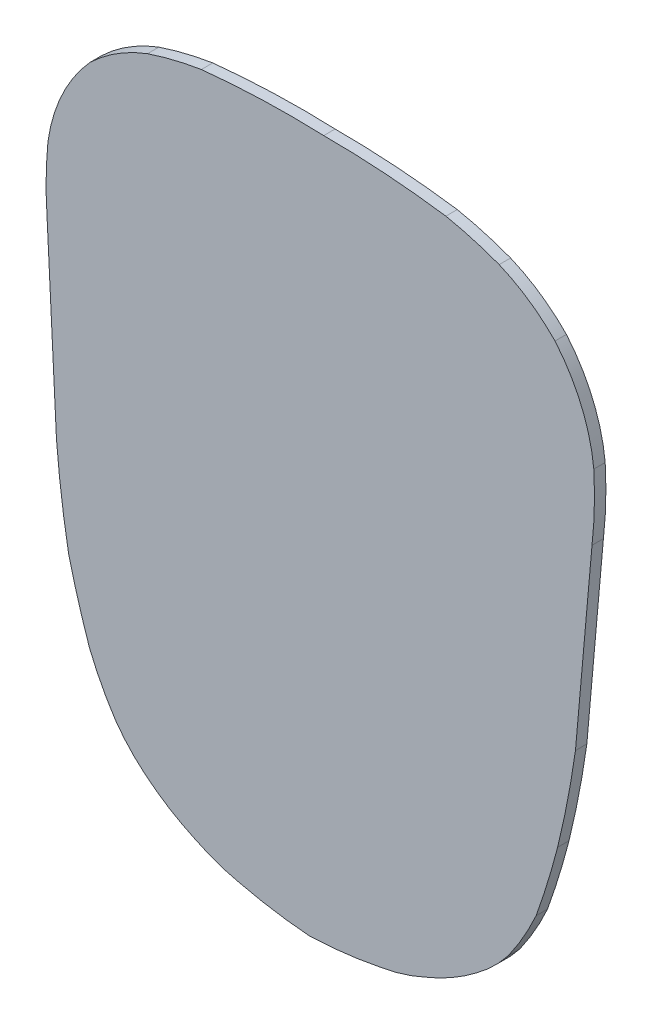
ISO-10303-21;
HEADER;
FILE_DESCRIPTION(('STEP AP214'),'2;1');
FILE_NAME('part.step','',(''),(''),'','','');
FILE_SCHEMA(('AUTOMOTIVE_DESIGN { 1 0 10303 214 1 1 1 1 }'));
ENDSEC;
DATA;
#1=APPLICATION_CONTEXT('core data for automotive mechanical design processes');
#2=APPLICATION_PROTOCOL_DEFINITION('international standard','automotive_design',2000,#1);
#3=PRODUCT_CONTEXT('',#1,'mechanical');
#4=PRODUCT('Part','Part','',(#3));
#5=PRODUCT_RELATED_PRODUCT_CATEGORY('part','',(#4));
#6=PRODUCT_DEFINITION_FORMATION('','',#4);
#7=PRODUCT_DEFINITION_CONTEXT('part definition',#1,'design');
#8=PRODUCT_DEFINITION('design','',#6,#7);
#9=PRODUCT_DEFINITION_SHAPE('','',#8);
#10=(LENGTH_UNIT() NAMED_UNIT(*) SI_UNIT(.MILLI.,.METRE.));
#11=(NAMED_UNIT(*) PLANE_ANGLE_UNIT() SI_UNIT($,.RADIAN.));
#12=(NAMED_UNIT(*) SI_UNIT($,.STERADIAN.) SOLID_ANGLE_UNIT());
#13=UNCERTAINTY_MEASURE_WITH_UNIT(LENGTH_MEASURE(1.E-05),#10,'distance_accuracy_value','');
#14=(GEOMETRIC_REPRESENTATION_CONTEXT(3) GLOBAL_UNCERTAINTY_ASSIGNED_CONTEXT((#13)) GLOBAL_UNIT_ASSIGNED_CONTEXT((#10,
#11,#12)) REPRESENTATION_CONTEXT('',''));
#15=CARTESIAN_POINT('',(0.,0.,0.));
#16=DIRECTION('',(0.,0.,1.));
#17=DIRECTION('',(1.,0.,0.));
#18=AXIS2_PLACEMENT_3D('',#15,#16,#17);
#19=CARTESIAN_POINT('',(-2.87645068487024,-22.2307778413904,40.6500965279302));
#20=DIRECTION('',(0.,0.,1.));
#21=DIRECTION('',(0.0193548335692301,0.999812677663925,0.));
#22=AXIS2_PLACEMENT_3D('',#19,#20,#21);
#23=PLANE('',#22);
#24=CARTESIAN_POINT('',(3.40605421210535,8.02001484887186,40.65009652793));
#25=DIRECTION('',(0.,0.,-1.));
#26=DIRECTION('',(-0.0193548335692301,-0.999812677663925,0.));
#27=AXIS2_PLACEMENT_3D('',#24,#25,#26);
#28=CIRCLE('',#27,7.43643173112);
#29=CARTESIAN_POINT('',(8.74976189327235,13.1916011731872,40.6500965279301));
#30=VERTEX_POINT('',#29);
#31=CARTESIAN_POINT('',(6.29473617833661,14.8724621043842,40.6500965279299));
#32=VERTEX_POINT('',#31);
#33=EDGE_CURVE('E400',#30,#32,#28,.F.);
#34=ORIENTED_EDGE('',*,*,#33,.F.);
#35=CARTESIAN_POINT('',(3.11803650286184,8.4313045354857,40.6500965279299));
#36=DIRECTION('',(0.,0.,-1.));
#37=DIRECTION('',(-0.0193548335692301,-0.999812677663925,0.));
#38=AXIS2_PLACEMENT_3D('',#35,#36,#37);
#39=CIRCLE('',#38,7.3740595978);
#40=CARTESIAN_POINT('',(10.4553019723893,9.16702892789537,40.6500965279302));
#41=VERTEX_POINT('',#40);
#42=EDGE_CURVE('E194',#41,#30,#39,.F.);
#43=ORIENTED_EDGE('',*,*,#42,.F.);
#44=CARTESIAN_POINT('',(-6.32552371849103,8.14421174061839,40.6500965279296));
#45=DIRECTION('',(0.,0.,-1.));
#46=DIRECTION('',(-0.0193548335692301,-0.999812677663925,0.));
#47=AXIS2_PLACEMENT_3D('',#44,#45,#46);
#48=CIRCLE('',#47,16.81196793556);
#49=CARTESIAN_POINT('',(10.3766044314372,6.22557130278915,40.6500965279302));
#50=VERTEX_POINT('',#49);
#51=EDGE_CURVE('E20',#50,#41,#48,.F.);
#52=ORIENTED_EDGE('',*,*,#51,.F.);
#53=DIRECTION('',(-0.0886995040357044,-0.996058431008854,0.));
#54=VECTOR('',#53,1.);
#55=CARTESIAN_POINT('',(10.3766044314372,6.22557130278917,40.6500965279302));
#56=LINE('',#55,#54);
#57=CARTESIAN_POINT('',(9.64811099468473,-1.9551061147509,40.6500965279303));
#58=VERTEX_POINT('',#57);
#59=EDGE_CURVE('E193',#50,#58,#56,.T.);
#60=ORIENTED_EDGE('',*,*,#59,.T.);
#61=CARTESIAN_POINT('',(-31.2814474166912,3.8013435473197,40.6500965279289));
#62=DIRECTION('',(0.,0.,-1.));
#63=DIRECTION('',(-0.0193548335692301,-0.999812677663925,0.));
#64=AXIS2_PLACEMENT_3D('',#61,#62,#63);
#65=CIRCLE('',#64,41.33237791928);
#66=CARTESIAN_POINT('',(8.86403234955439,-6.03257321052164,40.6500965279303));
#67=VERTEX_POINT('',#66);
#68=EDGE_CURVE('E206',#67,#58,#65,.F.);
#69=ORIENTED_EDGE('',*,*,#68,.F.);
#70=CARTESIAN_POINT('',(-24.9737606237931,2.68335405814092,40.6500965279291));
#71=DIRECTION('',(0.,0.,-1.));
#72=DIRECTION('',(-0.0193548335692301,-0.999812677663925,0.));
#73=AXIS2_PLACEMENT_3D('',#70,#71,#72);
#74=CIRCLE('',#73,34.94228987144);
#75=CARTESIAN_POINT('',(7.91947678147978,-9.10641075970414,40.6500965279303));
#76=VERTEX_POINT('',#75);
#77=EDGE_CURVE('E321',#76,#67,#74,.F.);
#78=ORIENTED_EDGE('',*,*,#77,.F.);
#79=CARTESIAN_POINT('',(-3.58067037627307,-3.93497982202901,40.6500965279299));
#80=DIRECTION('',(0.,0.,-1.));
#81=DIRECTION('',(-0.0193548335692301,-0.999812677663925,0.));
#82=AXIS2_PLACEMENT_3D('',#79,#80,#81);
#83=CIRCLE('',#82,12.60940452968);
#84=CARTESIAN_POINT('',(6.69776683055141,-11.2391437836663,40.6500965279303));
#85=VERTEX_POINT('',#84);
#86=EDGE_CURVE('E325',#85,#76,#83,.F.);
#87=ORIENTED_EDGE('',*,*,#86,.F.);
#88=CARTESIAN_POINT('',(1.10266886694135,-6.86934474010805,40.6500965279301));
#89=DIRECTION('',(0.,0.,-1.));
#90=DIRECTION('',(-0.0193548335692301,-0.999812677663925,0.));
#91=AXIS2_PLACEMENT_3D('',#88,#89,#90);
#92=CIRCLE('',#91,7.09931439672);
#93=CARTESIAN_POINT('',(5.30083998115858,-12.5943446701716,40.6500965279303));
#94=VERTEX_POINT('',#93);
#95=EDGE_CURVE('E329',#94,#85,#92,.F.);
#96=ORIENTED_EDGE('',*,*,#95,.F.);
#97=CARTESIAN_POINT('',(-0.638723059391889,-4.83953730632285,40.65009652793));
#98=DIRECTION('',(0.,0.,-1.));
#99=DIRECTION('',(-0.0193548335692301,-0.999812677663925,0.));
#100=AXIS2_PLACEMENT_3D('',#97,#98,#99);
#101=CIRCLE('',#100,9.76808304444);
#102=CARTESIAN_POINT('',(3.02325465351674,-13.8952187049387,40.6500965279303));
#103=VERTEX_POINT('',#102);
#104=EDGE_CURVE('E333',#103,#94,#101,.F.);
#105=ORIENTED_EDGE('',*,*,#104,.F.);
#106=CARTESIAN_POINT('',(-0.207770559998184,-6.83732878190935,40.6500965279301));
#107=DIRECTION('',(0.,0.,-1.));
#108=DIRECTION('',(-0.0193548335692301,-0.999812677663925,0.));
#109=AXIS2_PLACEMENT_3D('',#106,#107,#108);
#110=CIRCLE('',#109,7.76230211316);
#111=CARTESIAN_POINT('',(1.11765382111102,-14.4856347581324,40.6500965279302));
#112=VERTEX_POINT('',#111);
#113=EDGE_CURVE('E337',#112,#103,#110,.F.);
#114=ORIENTED_EDGE('',*,*,#113,.F.);
#115=CARTESIAN_POINT('',(-2.80966912930594,4.7550090968341,40.6500965279298));
#116=DIRECTION('',(0.,0.,-1.));
#117=DIRECTION('',(-0.0193548335692301,-0.999812677663925,0.));
#118=AXIS2_PLACEMENT_3D('',#115,#116,#117);
#119=CIRCLE('',#118,19.6373684976);
#120=CARTESIAN_POINT('',(-2.01526832310912,-14.8662846645275,40.6500965279301));
#121=VERTEX_POINT('',#120);
#122=EDGE_CURVE('E340',#121,#112,#119,.F.);
#123=ORIENTED_EDGE('',*,*,#122,.F.);
#124=CARTESIAN_POINT('',(-0.523207579480618,4.71400533480678,40.6500965279299));
#125=DIRECTION('',(0.,0.,-1.));
#126=DIRECTION('',(-0.0193548335692301,-0.999812677663925,0.));
#127=AXIS2_PLACEMENT_3D('',#124,#125,#126);
#128=CIRCLE('',#127,19.63705684976);
#129=CARTESIAN_POINT('',(-5.1763378218956,-14.3637927736708,40.65009652793));
#130=VERTEX_POINT('',#129);
#131=EDGE_CURVE('E344',#130,#121,#128,.F.);
#132=ORIENTED_EDGE('',*,*,#131,.F.);
#133=CARTESIAN_POINT('',(-3.55589855490557,-6.7725141805769,40.6500965279299));
#134=DIRECTION('',(0.,0.,-1.));
#135=DIRECTION('',(-0.0193548335692301,-0.999812677663925,0.));
#136=AXIS2_PLACEMENT_3D('',#133,#134,#135);
#137=CIRCLE('',#136,7.76230211316);
#138=CARTESIAN_POINT('',(-7.05766041396085,-13.7000677154429,40.6500965279299));
#139=VERTEX_POINT('',#138);
#140=EDGE_CURVE('E348',#139,#130,#137,.F.);
#141=ORIENTED_EDGE('',*,*,#140,.F.);
#142=CARTESIAN_POINT('',(-3.04794957670775,-4.79289839153915,40.6500965279299));
#143=DIRECTION('',(0.,0.,-1.));
#144=DIRECTION('',(-0.0193548335692301,-0.999812677663925,0.));
#145=AXIS2_PLACEMENT_3D('',#142,#143,#144);
#146=CIRCLE('',#145,9.76808304444);
#147=CARTESIAN_POINT('',(-9.28319236302833,-12.3120202657152,40.6500965279298));
#148=VERTEX_POINT('',#147);
#149=EDGE_CURVE('E352',#148,#139,#146,.F.);
#150=ORIENTED_EDGE('',*,*,#149,.F.);
#151=CARTESIAN_POINT('',(-4.76167465689594,-6.8387997753086,40.6500965279299));
#152=DIRECTION('',(0.,0.,-1.));
#153=DIRECTION('',(-0.0193548335692301,-0.999812677663925,0.));
#154=AXIS2_PLACEMENT_3D('',#151,#152,#153);
#155=CIRCLE('',#154,7.09931439672);
#156=CARTESIAN_POINT('',(-10.5813963887554,-10.9046457963967,40.6500965279298));
#157=VERTEX_POINT('',#156);
#158=EDGE_CURVE('E356',#157,#148,#155,.F.);
#159=ORIENTED_EDGE('',*,*,#158,.F.);
#160=CARTESIAN_POINT('',(-0.0279711922389195,-4.00375460651083,40.65009652793));
#161=DIRECTION('',(0.,0.,-1.));
#162=DIRECTION('',(-0.0193548335692301,-0.999812677663925,0.));
#163=AXIS2_PLACEMENT_3D('',#160,#161,#162);
#164=CIRCLE('',#163,12.60940452968);
#165=CARTESIAN_POINT('',(-11.719649090564,-8.72622753019504,40.6500965279297));
#166=VERTEX_POINT('',#165);
#167=EDGE_CURVE('E360',#166,#157,#164,.F.);
#168=ORIENTED_EDGE('',*,*,#167,.F.);
#169=CARTESIAN_POINT('',(21.3074102324666,2.68328490166432,40.6500965279306));
#170=DIRECTION('',(0.,0.,-1.));
#171=DIRECTION('',(-0.0193548335692301,-0.999812677663925,0.));
#172=AXIS2_PLACEMENT_3D('',#169,#170,#171);
#173=CIRCLE('',#172,34.94228987144);
#174=CARTESIAN_POINT('',(-12.6348799299237,-5.61638738053111,40.6500965279296));
#175=VERTEX_POINT('',#174);
#176=EDGE_CURVE('E364',#175,#166,#173,.F.);
#177=ORIENTED_EDGE('',*,*,#176,.F.);
#178=CARTESIAN_POINT('',(28.0310735031443,1.77588533100576,40.6500965279308));
#179=DIRECTION('',(0.,0.,-1.));
#180=DIRECTION('',(-0.0193548335692301,-0.999812677663925,0.));
#181=AXIS2_PLACEMENT_3D('',#178,#179,#180);
#182=CIRCLE('',#181,41.33237791928);
#183=CARTESIAN_POINT('',(-13.1702154109103,-1.51337845938617,40.6500965279295));
#184=VERTEX_POINT('',#183);
#185=EDGE_CURVE('E368',#184,#175,#182,.F.);
#186=ORIENTED_EDGE('',*,*,#185,.F.);
#187=DIRECTION('',(-0.0500831809567766,0.998745050042928,0.));
#188=VECTOR('',#187,1.);
#189=CARTESIAN_POINT('',(-13.1702154109104,-1.51337845938577,40.6500965279295));
#190=LINE('',#189,#188);
#191=CARTESIAN_POINT('',(-13.581551066226,6.6893642938588,40.6500965279294));
#192=VERTEX_POINT('',#191);
#193=EDGE_CURVE('E219',#184,#192,#190,.T.);
#194=ORIENTED_EDGE('',*,*,#193,.T.);
#195=CARTESIAN_POINT('',(3.18231954948573,7.96015453853931,40.6500965279299));
#196=DIRECTION('',(0.,0.,-1.));
#197=DIRECTION('',(-0.0193548335692301,-0.999812677663925,0.));
#198=AXIS2_PLACEMENT_3D('',#195,#196,#197);
#199=CIRCLE('',#198,16.81196793556);
#200=CARTESIAN_POINT('',(-13.5463481289566,9.63166390750373,40.6500965279294));
#201=VERTEX_POINT('',#200);
#202=EDGE_CURVE('E223',#201,#192,#199,.F.);
#203=ORIENTED_EDGE('',*,*,#202,.F.);
#204=CARTESIAN_POINT('',(-6.24305419079949,8.61252083374831,40.6500965279296));
#205=DIRECTION('',(0.,0.,-1.));
#206=DIRECTION('',(-0.0193548335692301,-0.999812677663925,0.));
#207=AXIS2_PLACEMENT_3D('',#204,#205,#206);
#208=CIRCLE('',#207,7.3740595978);
#209=CARTESIAN_POINT('',(-11.6863252040827,13.5872123445716,40.6500965279294));
#210=VERTEX_POINT('',#209);
#211=EDGE_CURVE('E376',#210,#201,#208,.F.);
#212=ORIENTED_EDGE('',*,*,#211,.F.);
#213=CARTESIAN_POINT('',(-6.54677401618397,8.21268627443506,40.6500965279296));
#214=DIRECTION('',(0.,0.,-1.));
#215=DIRECTION('',(-0.0193548335692301,-0.999812677663925,0.));
#216=AXIS2_PLACEMENT_3D('',#213,#214,#215);
#217=CIRCLE('',#216,7.43643173112);
#218=CARTESIAN_POINT('',(-9.16808546254466,15.17179851615,40.6500965279295));
#219=VERTEX_POINT('',#218);
#220=EDGE_CURVE('E380',#219,#210,#217,.F.);
#221=ORIENTED_EDGE('',*,*,#220,.F.);
#222=CARTESIAN_POINT('',(-4.43670572158516,1.02428534892834,40.6500965279298));
#223=DIRECTION('',(0.,0.,-1.));
#224=DIRECTION('',(-0.0193548335692301,-0.999812677663925,0.));
#225=AXIS2_PLACEMENT_3D('',#222,#223,#224);
#226=CIRCLE('',#225,14.91771038296);
#227=CARTESIAN_POINT('',(-6.80003650135277,15.7536013783737,40.6500965279295));
#228=VERTEX_POINT('',#227);
#229=EDGE_CURVE('E384',#228,#219,#226,.F.);
#230=ORIENTED_EDGE('',*,*,#229,.F.);
#231=CARTESIAN_POINT('',(-2.87645068487024,-22.2307778413904,40.6500965279302));
#232=DIRECTION('',(0.,0.,-1.));
#233=DIRECTION('',(-0.0193548335692301,-0.999812677663925,0.));
#234=AXIS2_PLACEMENT_3D('',#231,#232,#233);
#235=CIRCLE('',#234,38.18648439396);
#236=CARTESIAN_POINT('',(-1.41914055333817,15.9278887698879,40.6500965279297));
#237=VERTEX_POINT('',#236);
#238=EDGE_CURVE('E388',#237,#228,#235,.F.);
#239=ORIENTED_EDGE('',*,*,#238,.F.);
#240=CARTESIAN_POINT('',(-1.43975485684213,-22.2585901013477,40.6500965279302));
#241=DIRECTION('',(0.,0.,-1.));
#242=DIRECTION('',(-0.0193548335692301,-0.999812677663925,0.));
#243=AXIS2_PLACEMENT_3D('',#240,#241,#242);
#244=CIRCLE('',#243,38.186484435371);
#245=CARTESIAN_POINT('',(3.95097858118653,15.5454782846468,40.6500965279299));
#246=VERTEX_POINT('',#245);
#247=EDGE_CURVE('E392',#246,#237,#244,.F.);
#248=ORIENTED_EDGE('',*,*,#247,.F.);
#249=CARTESIAN_POINT('',(1.01935833845508,0.91866435193131,40.65009652793));
#250=DIRECTION('',(0.,0.,-1.));
#251=DIRECTION('',(-0.0193548335692301,-0.999812677663925,0.));
#252=AXIS2_PLACEMENT_3D('',#249,#250,#251);
#253=CIRCLE('',#252,14.91771038296);
#254=EDGE_CURVE('E396',#32,#246,#253,.F.);
#255=ORIENTED_EDGE('',*,*,#254,.F.);
#256=EDGE_LOOP('',(#34,#43,#52,#60,#69,#78,#87,#96,#105,#114,#123,#132,#141,#150,#159,#168,#177,
#186,#194,#203,#212,#221,#230,#239,#248,#255));
#257=FACE_BOUND('',#256,.T.);
#258=ADVANCED_FACE('F17',(#257),#23,.F.);
#259=CARTESIAN_POINT('',(-6.32552371849104,8.1442117406184,41.0310965279296));
#260=DIRECTION('',(0.,0.,-1.));
#261=DIRECTION('',(-0.0193548335692301,-0.999812677663925,0.));
#262=AXIS2_PLACEMENT_3D('',#259,#260,#261);
#263=CYLINDRICAL_SURFACE('',#262,16.81196793556);
#264=DIRECTION('',(0.,0.,-1.));
#265=VECTOR('',#264,1.);
#266=CARTESIAN_POINT('',(10.4553019723893,9.16702892789542,41.0310965279302));
#267=LINE('',#266,#265);
#268=CARTESIAN_POINT('',(10.4553019723893,9.1670289278954,41.1510965279302));
#269=VERTEX_POINT('',#268);
#270=EDGE_CURVE('E198',#269,#41,#267,.T.);
#271=ORIENTED_EDGE('',*,*,#270,.F.);
#272=CARTESIAN_POINT('',(-6.32552371849105,8.1442117406184,41.1510965279296));
#273=DIRECTION('',(0.,0.,-1.));
#274=DIRECTION('',(-0.0193548335692301,-0.999812677663925,0.));
#275=AXIS2_PLACEMENT_3D('',#272,#273,#274);
#276=CIRCLE('',#275,16.81196793556);
#277=CARTESIAN_POINT('',(10.3766044314372,6.22557130278928,41.1510965279302));
#278=VERTEX_POINT('',#277);
#279=EDGE_CURVE('E203',#278,#269,#276,.F.);
#280=ORIENTED_EDGE('',*,*,#279,.F.);
#281=DIRECTION('',(0.,0.,1.));
#282=VECTOR('',#281,1.);
#283=CARTESIAN_POINT('',(10.3766044314372,6.22557130278919,41.0310965279302));
#284=LINE('',#283,#282);
#285=EDGE_CURVE('E200',#278,#50,#284,.F.);
#286=ORIENTED_EDGE('',*,*,#285,.T.);
#287=ORIENTED_EDGE('',*,*,#51,.T.);
#288=EDGE_LOOP('',(#271,#280,#286,#287));
#289=FACE_BOUND('',#288,.T.);
#290=ADVANCED_FACE('F201',(#289),#263,.T.);
#291=CARTESIAN_POINT('',(3.11803650286183,8.43130453548571,41.0310965279299));
#292=DIRECTION('',(0.,0.,-1.));
#293=DIRECTION('',(-0.0193548335692301,-0.999812677663925,0.));
#294=AXIS2_PLACEMENT_3D('',#291,#292,#293);
#295=CYLINDRICAL_SURFACE('',#294,7.3740595978);
#296=DIRECTION('',(0.,0.,-1.));
#297=VECTOR('',#296,1.);
#298=CARTESIAN_POINT('',(8.74976189327234,13.1916011731872,41.03109652793));
#299=LINE('',#298,#297);
#300=CARTESIAN_POINT('',(8.74976189327234,13.1916011731872,41.15109652793));
#301=VERTEX_POINT('',#300);
#302=EDGE_CURVE('E402',#301,#30,#299,.T.);
#303=ORIENTED_EDGE('',*,*,#302,.F.);
#304=CARTESIAN_POINT('',(3.11803650286183,8.43130453548571,41.1510965279299));
#305=DIRECTION('',(0.,0.,-1.));
#306=DIRECTION('',(-0.0193548335692301,-0.999812677663925,0.));
#307=AXIS2_PLACEMENT_3D('',#304,#305,#306);
#308=CIRCLE('',#307,7.3740595978);
#309=EDGE_CURVE('E312',#269,#301,#308,.F.);
#310=ORIENTED_EDGE('',*,*,#309,.F.);
#311=ORIENTED_EDGE('',*,*,#270,.T.);
#312=ORIENTED_EDGE('',*,*,#42,.T.);
#313=EDGE_LOOP('',(#303,#310,#311,#312));
#314=FACE_BOUND('',#313,.T.);
#315=ADVANCED_FACE('F410',(#314),#295,.T.);
#316=CARTESIAN_POINT('',(3.40605421210534,8.02001484887187,41.03109652793));
#317=DIRECTION('',(0.,0.,-1.));
#318=DIRECTION('',(-0.0193548335692301,-0.999812677663925,0.));
#319=AXIS2_PLACEMENT_3D('',#316,#317,#318);
#320=CYLINDRICAL_SURFACE('',#319,7.43643173112);
#321=DIRECTION('',(0.,0.,-1.));
#322=VECTOR('',#321,1.);
#323=CARTESIAN_POINT('',(6.2947361783366,14.8724621043842,41.0310965279299));
#324=LINE('',#323,#322);
#325=CARTESIAN_POINT('',(6.29473617833659,14.8724621043842,41.1510965279299));
#326=VERTEX_POINT('',#325);
#327=EDGE_CURVE('E399',#326,#32,#324,.T.);
#328=ORIENTED_EDGE('',*,*,#327,.F.);
#329=CARTESIAN_POINT('',(3.40605421210533,8.02001484887187,41.15109652793));
#330=DIRECTION('',(0.,0.,-1.));
#331=DIRECTION('',(-0.0193548335692301,-0.999812677663925,0.));
#332=AXIS2_PLACEMENT_3D('',#329,#330,#331);
#333=CIRCLE('',#332,7.43643173112);
#334=EDGE_CURVE('E308',#301,#326,#333,.F.);
#335=ORIENTED_EDGE('',*,*,#334,.F.);
#336=ORIENTED_EDGE('',*,*,#302,.T.);
#337=ORIENTED_EDGE('',*,*,#33,.T.);
#338=EDGE_LOOP('',(#328,#335,#336,#337));
#339=FACE_BOUND('',#338,.T.);
#340=ADVANCED_FACE('F486',(#339),#320,.T.);
#341=CARTESIAN_POINT('',(1.01935833845507,0.918664351931317,41.03109652793));
#342=DIRECTION('',(0.,0.,-1.));
#343=DIRECTION('',(-0.0193548335692301,-0.999812677663925,0.));
#344=AXIS2_PLACEMENT_3D('',#341,#342,#343);
#345=CYLINDRICAL_SURFACE('',#344,14.91771038296);
#346=DIRECTION('',(0.,0.,-1.));
#347=VECTOR('',#346,1.);
#348=CARTESIAN_POINT('',(3.95097858118655,15.5454782846468,41.0310965279299));
#349=LINE('',#348,#347);
#350=CARTESIAN_POINT('',(3.95097858118653,15.5454782846468,41.1510965279299));
#351=VERTEX_POINT('',#350);
#352=EDGE_CURVE('E395',#351,#246,#349,.T.);
#353=ORIENTED_EDGE('',*,*,#352,.F.);
#354=CARTESIAN_POINT('',(1.01935833845506,0.918664351931319,41.15109652793));
#355=DIRECTION('',(0.,0.,-1.));
#356=DIRECTION('',(-0.0193548335692301,-0.999812677663925,0.));
#357=AXIS2_PLACEMENT_3D('',#354,#355,#356);
#358=CIRCLE('',#357,14.91771038296);
#359=EDGE_CURVE('E304',#326,#351,#358,.F.);
#360=ORIENTED_EDGE('',*,*,#359,.F.);
#361=ORIENTED_EDGE('',*,*,#327,.T.);
#362=ORIENTED_EDGE('',*,*,#254,.T.);
#363=EDGE_LOOP('',(#353,#360,#361,#362));
#364=FACE_BOUND('',#363,.T.);
#365=ADVANCED_FACE('F482',(#364),#345,.T.);
#366=CARTESIAN_POINT('',(-1.43975485684214,-22.2585901013477,41.0310965279302));
#367=DIRECTION('',(0.,0.,-1.));
#368=DIRECTION('',(-0.0193548335692301,-0.999812677663925,0.));
#369=AXIS2_PLACEMENT_3D('',#366,#367,#368);
#370=CYLINDRICAL_SURFACE('',#369,38.186484435371);
#371=DIRECTION('',(0.,0.,-1.));
#372=VECTOR('',#371,1.);
#373=CARTESIAN_POINT('',(-1.41914055333808,15.9278887698879,41.0310965279297));
#374=LINE('',#373,#372);
#375=CARTESIAN_POINT('',(-1.41914055333819,15.9278887698879,41.1510965279297));
#376=VERTEX_POINT('',#375);
#377=EDGE_CURVE('E391',#376,#237,#374,.T.);
#378=ORIENTED_EDGE('',*,*,#377,.F.);
#379=CARTESIAN_POINT('',(-1.43975485684214,-22.2585901013477,41.1510965279302));
#380=DIRECTION('',(0.,0.,-1.));
#381=DIRECTION('',(-0.0193548335692301,-0.999812677663925,0.));
#382=AXIS2_PLACEMENT_3D('',#379,#380,#381);
#383=CIRCLE('',#382,38.186484435371);
#384=EDGE_CURVE('E300',#351,#376,#383,.F.);
#385=ORIENTED_EDGE('',*,*,#384,.F.);
#386=ORIENTED_EDGE('',*,*,#352,.T.);
#387=ORIENTED_EDGE('',*,*,#247,.T.);
#388=EDGE_LOOP('',(#378,#385,#386,#387));
#389=FACE_BOUND('',#388,.T.);
#390=ADVANCED_FACE('F491',(#389),#370,.T.);
#391=CARTESIAN_POINT('',(-2.87645068487026,-22.2307778413904,41.0310965279302));
#392=DIRECTION('',(0.,0.,-1.));
#393=DIRECTION('',(-0.0193548335692301,-0.999812677663925,0.));
#394=AXIS2_PLACEMENT_3D('',#391,#392,#393);
#395=CYLINDRICAL_SURFACE('',#394,38.18648439396);
#396=DIRECTION('',(0.,0.,-1.));
#397=VECTOR('',#396,1.);
#398=CARTESIAN_POINT('',(-6.80003650135279,15.7536013783737,41.0310965279295));
#399=LINE('',#398,#397);
#400=CARTESIAN_POINT('',(-6.80003650135281,15.7536013783737,41.1510965279295));
#401=VERTEX_POINT('',#400);
#402=EDGE_CURVE('E387',#401,#228,#399,.T.);
#403=ORIENTED_EDGE('',*,*,#402,.F.);
#404=CARTESIAN_POINT('',(-2.87645068487026,-22.2307778413904,41.1510965279302));
#405=DIRECTION('',(0.,0.,-1.));
#406=DIRECTION('',(-0.0193548335692301,-0.999812677663925,0.));
#407=AXIS2_PLACEMENT_3D('',#404,#405,#406);
#408=CIRCLE('',#407,38.18648439396);
#409=EDGE_CURVE('E296',#376,#401,#408,.F.);
#410=ORIENTED_EDGE('',*,*,#409,.F.);
#411=ORIENTED_EDGE('',*,*,#377,.T.);
#412=ORIENTED_EDGE('',*,*,#238,.T.);
#413=EDGE_LOOP('',(#403,#410,#411,#412));
#414=FACE_BOUND('',#413,.T.);
#415=ADVANCED_FACE('F495',(#414),#395,.T.);
#416=CARTESIAN_POINT('',(-4.43670572158517,1.02428534892834,41.0310965279298));
#417=DIRECTION('',(0.,0.,-1.));
#418=DIRECTION('',(-0.0193548335692301,-0.999812677663925,0.));
#419=AXIS2_PLACEMENT_3D('',#416,#417,#418);
#420=CYLINDRICAL_SURFACE('',#419,14.91771038296);
#421=DIRECTION('',(0.,0.,-1.));
#422=VECTOR('',#421,1.);
#423=CARTESIAN_POINT('',(-9.16808546254464,15.17179851615,41.0310965279295));
#424=LINE('',#423,#422);
#425=CARTESIAN_POINT('',(-9.16808546254467,15.17179851615,41.1510965279294));
#426=VERTEX_POINT('',#425);
#427=EDGE_CURVE('E383',#426,#219,#424,.T.);
#428=ORIENTED_EDGE('',*,*,#427,.F.);
#429=CARTESIAN_POINT('',(-4.43670572158517,1.02428534892834,41.1510965279298));
#430=DIRECTION('',(0.,0.,-1.));
#431=DIRECTION('',(-0.0193548335692301,-0.999812677663925,0.));
#432=AXIS2_PLACEMENT_3D('',#429,#430,#431);
#433=CIRCLE('',#432,14.91771038296);
#434=EDGE_CURVE('E292',#401,#426,#433,.F.);
#435=ORIENTED_EDGE('',*,*,#434,.F.);
#436=ORIENTED_EDGE('',*,*,#402,.T.);
#437=ORIENTED_EDGE('',*,*,#229,.T.);
#438=EDGE_LOOP('',(#428,#435,#436,#437));
#439=FACE_BOUND('',#438,.T.);
#440=ADVANCED_FACE('F497',(#439),#420,.T.);
#441=CARTESIAN_POINT('',(-6.54677401618398,8.21268627443507,41.0310965279296));
#442=DIRECTION('',(0.,0.,-1.));
#443=DIRECTION('',(-0.0193548335692301,-0.999812677663925,0.));
#444=AXIS2_PLACEMENT_3D('',#441,#442,#443);
#445=CYLINDRICAL_SURFACE('',#444,7.43643173112);
#446=DIRECTION('',(0.,0.,-1.));
#447=VECTOR('',#446,1.);
#448=CARTESIAN_POINT('',(-11.6863252040827,13.5872123445716,41.0310965279294));
#449=LINE('',#448,#447);
#450=CARTESIAN_POINT('',(-11.6863252040827,13.5872123445716,41.1510965279294));
#451=VERTEX_POINT('',#450);
#452=EDGE_CURVE('E379',#451,#210,#449,.T.);
#453=ORIENTED_EDGE('',*,*,#452,.F.);
#454=CARTESIAN_POINT('',(-6.54677401618398,8.21268627443507,41.1510965279296));
#455=DIRECTION('',(0.,0.,-1.));
#456=DIRECTION('',(-0.0193548335692301,-0.999812677663925,0.));
#457=AXIS2_PLACEMENT_3D('',#454,#455,#456);
#458=CIRCLE('',#457,7.43643173112);
#459=EDGE_CURVE('E288',#426,#451,#458,.F.);
#460=ORIENTED_EDGE('',*,*,#459,.F.);
#461=ORIENTED_EDGE('',*,*,#427,.T.);
#462=ORIENTED_EDGE('',*,*,#220,.T.);
#463=EDGE_LOOP('',(#453,#460,#461,#462));
#464=FACE_BOUND('',#463,.T.);
#465=ADVANCED_FACE('F501',(#464),#445,.T.);
#466=CARTESIAN_POINT('',(-6.24305419079951,8.61252083374832,41.0310965279296));
#467=DIRECTION('',(0.,0.,-1.));
#468=DIRECTION('',(-0.0193548335692301,-0.999812677663925,0.));
#469=AXIS2_PLACEMENT_3D('',#466,#467,#468);
#470=CYLINDRICAL_SURFACE('',#469,7.3740595978);
#471=DIRECTION('',(0.,0.,-1.));
#472=VECTOR('',#471,1.);
#473=CARTESIAN_POINT('',(-13.5463481289566,9.63166390750374,41.0310965279294));
#474=LINE('',#473,#472);
#475=CARTESIAN_POINT('',(-13.5463481289566,9.63166390750374,41.1510965279294));
#476=VERTEX_POINT('',#475);
#477=EDGE_CURVE('E375',#476,#201,#474,.T.);
#478=ORIENTED_EDGE('',*,*,#477,.F.);
#479=CARTESIAN_POINT('',(-6.24305419079951,8.61252083374832,41.1510965279296));
#480=DIRECTION('',(0.,0.,-1.));
#481=DIRECTION('',(-0.0193548335692301,-0.999812677663925,0.));
#482=AXIS2_PLACEMENT_3D('',#479,#480,#481);
#483=CIRCLE('',#482,7.3740595978);
#484=EDGE_CURVE('E284',#451,#476,#483,.F.);
#485=ORIENTED_EDGE('',*,*,#484,.F.);
#486=ORIENTED_EDGE('',*,*,#452,.T.);
#487=ORIENTED_EDGE('',*,*,#211,.T.);
#488=EDGE_LOOP('',(#478,#485,#486,#487));
#489=FACE_BOUND('',#488,.T.);
#490=ADVANCED_FACE('F506',(#489),#470,.T.);
#491=CARTESIAN_POINT('',(3.18231954948572,7.96015453853931,41.0310965279299));
#492=DIRECTION('',(0.,0.,-1.));
#493=DIRECTION('',(-0.0193548335692301,-0.999812677663925,0.));
#494=AXIS2_PLACEMENT_3D('',#491,#492,#493);
#495=CYLINDRICAL_SURFACE('',#494,16.81196793556);
#496=DIRECTION('',(0.,0.,1.));
#497=VECTOR('',#496,1.);
#498=CARTESIAN_POINT('',(-13.581551066226,6.68936429385883,41.0310965279294));
#499=LINE('',#498,#497);
#500=CARTESIAN_POINT('',(-13.581551066226,6.68936429385881,41.1510965279294));
#501=VERTEX_POINT('',#500);
#502=EDGE_CURVE('E222',#192,#501,#499,.T.);
#503=ORIENTED_EDGE('',*,*,#502,.T.);
#504=CARTESIAN_POINT('',(3.18231954948571,7.96015453853931,41.1510965279299));
#505=DIRECTION('',(0.,0.,-1.));
#506=DIRECTION('',(-0.0193548335692301,-0.999812677663925,0.));
#507=AXIS2_PLACEMENT_3D('',#504,#505,#506);
#508=CIRCLE('',#507,16.81196793556);
#509=EDGE_CURVE('E280',#476,#501,#508,.F.);
#510=ORIENTED_EDGE('',*,*,#509,.F.);
#511=ORIENTED_EDGE('',*,*,#477,.T.);
#512=ORIENTED_EDGE('',*,*,#202,.T.);
#513=EDGE_LOOP('',(#503,#510,#511,#512));
#514=FACE_BOUND('',#513,.T.);
#515=ADVANCED_FACE('F510',(#514),#495,.T.);
#516=CARTESIAN_POINT('',(-13.1702154109104,-1.51337845938577,41.0310965279295));
#517=DIRECTION('',(0.998745050042928,0.0500831809567766,0.));
#518=DIRECTION('',(-0.0500831809567766,0.998745050042928,0.));
#519=AXIS2_PLACEMENT_3D('',#516,#517,#518);
#520=PLANE('',#519);
#521=ORIENTED_EDGE('',*,*,#502,.F.);
#522=ORIENTED_EDGE('',*,*,#193,.F.);
#523=DIRECTION('',(0.,0.,-1.));
#524=VECTOR('',#523,1.);
#525=CARTESIAN_POINT('',(-13.1702154109104,-1.51337845938598,41.0310965279295));
#526=LINE('',#525,#524);
#527=CARTESIAN_POINT('',(-13.1702154109104,-1.51337845938603,41.1510965279295));
#528=VERTEX_POINT('',#527);
#529=EDGE_CURVE('E371',#528,#184,#526,.T.);
#530=ORIENTED_EDGE('',*,*,#529,.F.);
#531=DIRECTION('',(0.050083180956776,-0.998745050042928,0.));
#532=VECTOR('',#531,1.);
#533=CARTESIAN_POINT('',(-13.581551066226,6.68936429385877,41.1510965279294));
#534=LINE('',#533,#532);
#535=EDGE_CURVE('E279',#501,#528,#534,.T.);
#536=ORIENTED_EDGE('',*,*,#535,.F.);
#537=EDGE_LOOP('',(#521,#522,#530,#536));
#538=FACE_BOUND('',#537,.T.);
#539=ADVANCED_FACE('F514',(#538),#520,.F.);
#540=CARTESIAN_POINT('',(28.0310735031443,1.77588533100576,41.0310965279308));
#541=DIRECTION('',(0.,0.,-1.));
#542=DIRECTION('',(-0.0193548335692301,-0.999812677663925,0.));
#543=AXIS2_PLACEMENT_3D('',#540,#541,#542);
#544=CYLINDRICAL_SURFACE('',#543,41.33237791928);
#545=DIRECTION('',(0.,0.,-1.));
#546=VECTOR('',#545,1.);
#547=CARTESIAN_POINT('',(-12.6348799299237,-5.61638738053119,41.0310965279296));
#548=LINE('',#547,#546);
#549=CARTESIAN_POINT('',(-12.6348799299237,-5.6163873805311,41.1510965279296));
#550=VERTEX_POINT('',#549);
#551=EDGE_CURVE('E367',#550,#175,#548,.T.);
#552=ORIENTED_EDGE('',*,*,#551,.F.);
#553=CARTESIAN_POINT('',(28.0310735031443,1.77588533100576,41.1510965279308));
#554=DIRECTION('',(0.,0.,-1.));
#555=DIRECTION('',(-0.0193548335692301,-0.999812677663925,0.));
#556=AXIS2_PLACEMENT_3D('',#553,#554,#555);
#557=CIRCLE('',#556,41.33237791928);
#558=EDGE_CURVE('E275',#528,#550,#557,.F.);
#559=ORIENTED_EDGE('',*,*,#558,.F.);
#560=ORIENTED_EDGE('',*,*,#529,.T.);
#561=ORIENTED_EDGE('',*,*,#185,.T.);
#562=EDGE_LOOP('',(#552,#559,#560,#561));
#563=FACE_BOUND('',#562,.T.);
#564=ADVANCED_FACE('F522',(#563),#544,.T.);
#565=CARTESIAN_POINT('',(21.3074102324666,2.68328490166432,41.0310965279306));
#566=DIRECTION('',(0.,0.,-1.));
#567=DIRECTION('',(-0.0193548335692301,-0.999812677663925,0.));
#568=AXIS2_PLACEMENT_3D('',#565,#566,#567);
#569=CYLINDRICAL_SURFACE('',#568,34.94228987144);
#570=DIRECTION('',(0.,0.,-1.));
#571=VECTOR('',#570,1.);
#572=CARTESIAN_POINT('',(-11.7196490905641,-8.72622753019499,41.0310965279297));
#573=LINE('',#572,#571);
#574=CARTESIAN_POINT('',(-11.7196490905641,-8.726227530195,41.1510965279297));
#575=VERTEX_POINT('',#574);
#576=EDGE_CURVE('E363',#575,#166,#573,.T.);
#577=ORIENTED_EDGE('',*,*,#576,.F.);
#578=CARTESIAN_POINT('',(21.3074102324666,2.68328490166432,41.1510965279305));
#579=DIRECTION('',(0.,0.,-1.));
#580=DIRECTION('',(-0.0193548335692301,-0.999812677663925,0.));
#581=AXIS2_PLACEMENT_3D('',#578,#579,#580);
#582=CIRCLE('',#581,34.94228987144);
#583=EDGE_CURVE('E271',#550,#575,#582,.F.);
#584=ORIENTED_EDGE('',*,*,#583,.F.);
#585=ORIENTED_EDGE('',*,*,#551,.T.);
#586=ORIENTED_EDGE('',*,*,#176,.T.);
#587=EDGE_LOOP('',(#577,#584,#585,#586));
#588=FACE_BOUND('',#587,.T.);
#589=ADVANCED_FACE('F526',(#588),#569,.T.);
#590=CARTESIAN_POINT('',(-0.0279711922389317,-4.00375460651083,41.03109652793));
#591=DIRECTION('',(0.,0.,-1.));
#592=DIRECTION('',(-0.0193548335692301,-0.999812677663925,0.));
#593=AXIS2_PLACEMENT_3D('',#590,#591,#592);
#594=CYLINDRICAL_SURFACE('',#593,12.60940452968);
#595=DIRECTION('',(0.,0.,-1.));
#596=VECTOR('',#595,1.);
#597=CARTESIAN_POINT('',(-10.5813963887555,-10.9046457963967,41.0310965279298));
#598=LINE('',#597,#596);
#599=CARTESIAN_POINT('',(-10.5813963887554,-10.9046457963967,41.1510965279297));
#600=VERTEX_POINT('',#599);
#601=EDGE_CURVE('E359',#600,#157,#598,.T.);
#602=ORIENTED_EDGE('',*,*,#601,.F.);
#603=CARTESIAN_POINT('',(-0.0279711922389356,-4.00375460651083,41.15109652793));
#604=DIRECTION('',(0.,0.,-1.));
#605=DIRECTION('',(-0.0193548335692301,-0.999812677663925,0.));
#606=AXIS2_PLACEMENT_3D('',#603,#604,#605);
#607=CIRCLE('',#606,12.60940452968);
#608=EDGE_CURVE('E267',#575,#600,#607,.F.);
#609=ORIENTED_EDGE('',*,*,#608,.F.);
#610=ORIENTED_EDGE('',*,*,#576,.T.);
#611=ORIENTED_EDGE('',*,*,#167,.T.);
#612=EDGE_LOOP('',(#602,#609,#610,#611));
#613=FACE_BOUND('',#612,.T.);
#614=ADVANCED_FACE('F530',(#613),#594,.T.);
#615=CARTESIAN_POINT('',(-4.76167465689596,-6.83879977530859,41.0310965279299));
#616=DIRECTION('',(0.,0.,-1.));
#617=DIRECTION('',(-0.0193548335692301,-0.999812677663925,0.));
#618=AXIS2_PLACEMENT_3D('',#615,#616,#617);
#619=CYLINDRICAL_SURFACE('',#618,7.09931439672);
#620=DIRECTION('',(0.,0.,-1.));
#621=VECTOR('',#620,1.);
#622=CARTESIAN_POINT('',(-9.28319236302901,-12.3120202657147,41.0310965279298));
#623=LINE('',#622,#621);
#624=CARTESIAN_POINT('',(-9.28319236302829,-12.3120202657153,41.1510965279298));
#625=VERTEX_POINT('',#624);
#626=EDGE_CURVE('E355',#625,#148,#623,.T.);
#627=ORIENTED_EDGE('',*,*,#626,.F.);
#628=CARTESIAN_POINT('',(-4.76167465689596,-6.83879977530859,41.1510965279299));
#629=DIRECTION('',(0.,0.,-1.));
#630=DIRECTION('',(-0.0193548335692301,-0.999812677663925,0.));
#631=AXIS2_PLACEMENT_3D('',#628,#629,#630);
#632=CIRCLE('',#631,7.09931439672);
#633=EDGE_CURVE('E263',#600,#625,#632,.F.);
#634=ORIENTED_EDGE('',*,*,#633,.F.);
#635=ORIENTED_EDGE('',*,*,#601,.T.);
#636=ORIENTED_EDGE('',*,*,#158,.T.);
#637=EDGE_LOOP('',(#627,#634,#635,#636));
#638=FACE_BOUND('',#637,.T.);
#639=ADVANCED_FACE('F534',(#638),#619,.T.);
#640=CARTESIAN_POINT('',(-3.04794957670776,-4.79289839153915,41.0310965279299));
#641=DIRECTION('',(0.,0.,-1.));
#642=DIRECTION('',(-0.0193548335692301,-0.999812677663925,0.));
#643=AXIS2_PLACEMENT_3D('',#640,#641,#642);
#644=CYLINDRICAL_SURFACE('',#643,9.76808304444);
#645=DIRECTION('',(0.,0.,-1.));
#646=VECTOR('',#645,1.);
#647=CARTESIAN_POINT('',(-7.05766041396086,-13.7000677154429,41.0310965279299));
#648=LINE('',#647,#646);
#649=CARTESIAN_POINT('',(-7.05766041396087,-13.7000677154429,41.1510965279299));
#650=VERTEX_POINT('',#649);
#651=EDGE_CURVE('E351',#650,#139,#648,.T.);
#652=ORIENTED_EDGE('',*,*,#651,.F.);
#653=CARTESIAN_POINT('',(-3.04794957670776,-4.79289839153915,41.1510965279299));
#654=DIRECTION('',(0.,0.,-1.));
#655=DIRECTION('',(-0.0193548335692301,-0.999812677663925,0.));
#656=AXIS2_PLACEMENT_3D('',#653,#654,#655);
#657=CIRCLE('',#656,9.76808304444);
#658=EDGE_CURVE('E259',#625,#650,#657,.F.);
#659=ORIENTED_EDGE('',*,*,#658,.F.);
#660=ORIENTED_EDGE('',*,*,#626,.T.);
#661=ORIENTED_EDGE('',*,*,#149,.T.);
#662=EDGE_LOOP('',(#652,#659,#660,#661));
#663=FACE_BOUND('',#662,.T.);
#664=ADVANCED_FACE('F538',(#663),#644,.T.);
#665=CARTESIAN_POINT('',(-3.55589855490558,-6.77251418057689,41.0310965279299));
#666=DIRECTION('',(0.,0.,-1.));
#667=DIRECTION('',(-0.0193548335692301,-0.999812677663925,0.));
#668=AXIS2_PLACEMENT_3D('',#665,#666,#667);
#669=CYLINDRICAL_SURFACE('',#668,7.76230211316);
#670=DIRECTION('',(0.,0.,-1.));
#671=VECTOR('',#670,1.);
#672=CARTESIAN_POINT('',(-5.17633782189558,-14.3637927736708,41.03109652793));
#673=LINE('',#672,#671);
#674=CARTESIAN_POINT('',(-5.17633782189556,-14.3637927736708,41.15109652793));
#675=VERTEX_POINT('',#674);
#676=EDGE_CURVE('E347',#675,#130,#673,.T.);
#677=ORIENTED_EDGE('',*,*,#676,.F.);
#678=CARTESIAN_POINT('',(-3.55589855490558,-6.77251418057689,41.1510965279299));
#679=DIRECTION('',(0.,0.,-1.));
#680=DIRECTION('',(-0.0193548335692301,-0.999812677663925,0.));
#681=AXIS2_PLACEMENT_3D('',#678,#679,#680);
#682=CIRCLE('',#681,7.76230211316);
#683=EDGE_CURVE('E255',#650,#675,#682,.F.);
#684=ORIENTED_EDGE('',*,*,#683,.F.);
#685=ORIENTED_EDGE('',*,*,#651,.T.);
#686=ORIENTED_EDGE('',*,*,#140,.T.);
#687=EDGE_LOOP('',(#677,#684,#685,#686));
#688=FACE_BOUND('',#687,.T.);
#689=ADVANCED_FACE('F542',(#688),#669,.T.);
#690=CARTESIAN_POINT('',(-0.523207579480631,4.71400533480679,41.0310965279299));
#691=DIRECTION('',(0.,0.,-1.));
#692=DIRECTION('',(-0.0193548335692301,-0.999812677663925,0.));
#693=AXIS2_PLACEMENT_3D('',#690,#691,#692);
#694=CYLINDRICAL_SURFACE('',#693,19.63705684976);
#695=DIRECTION('',(0.,0.,-1.));
#696=VECTOR('',#695,1.);
#697=CARTESIAN_POINT('',(-2.01526832310913,-14.8662846645275,41.0310965279301));
#698=LINE('',#697,#696);
#699=CARTESIAN_POINT('',(-2.01526832310914,-14.8662846645275,41.1510965279301));
#700=VERTEX_POINT('',#699);
#701=EDGE_CURVE('E343',#700,#121,#698,.T.);
#702=ORIENTED_EDGE('',*,*,#701,.F.);
#703=CARTESIAN_POINT('',(-0.523207579480634,4.71400533480679,41.1510965279299));
#704=DIRECTION('',(0.,0.,-1.));
#705=DIRECTION('',(-0.0193548335692301,-0.999812677663925,0.));
#706=AXIS2_PLACEMENT_3D('',#703,#704,#705);
#707=CIRCLE('',#706,19.63705684976);
#708=EDGE_CURVE('E251',#675,#700,#707,.F.);
#709=ORIENTED_EDGE('',*,*,#708,.F.);
#710=ORIENTED_EDGE('',*,*,#676,.T.);
#711=ORIENTED_EDGE('',*,*,#131,.T.);
#712=EDGE_LOOP('',(#702,#709,#710,#711));
#713=FACE_BOUND('',#712,.T.);
#714=ADVANCED_FACE('F546',(#713),#694,.T.);
#715=CARTESIAN_POINT('',(-2.80966912930595,4.75500909683411,41.0310965279298));
#716=DIRECTION('',(0.,0.,-1.));
#717=DIRECTION('',(-0.0193548335692301,-0.999812677663925,0.));
#718=AXIS2_PLACEMENT_3D('',#715,#716,#717);
#719=CYLINDRICAL_SURFACE('',#718,19.6373684976);
#720=DIRECTION('',(0.,0.,-1.));
#721=VECTOR('',#720,1.);
#722=CARTESIAN_POINT('',(1.11765382111103,-14.4856347581324,41.0310965279302));
#723=LINE('',#722,#721);
#724=CARTESIAN_POINT('',(1.11765382111102,-14.4856347581324,41.1510965279302));
#725=VERTEX_POINT('',#724);
#726=EDGE_CURVE('E339',#725,#112,#723,.T.);
#727=ORIENTED_EDGE('',*,*,#726,.F.);
#728=CARTESIAN_POINT('',(-2.80966912930596,4.75500909683411,41.1510965279298));
#729=DIRECTION('',(0.,0.,-1.));
#730=DIRECTION('',(-0.0193548335692301,-0.999812677663925,0.));
#731=AXIS2_PLACEMENT_3D('',#728,#729,#730);
#732=CIRCLE('',#731,19.6373684976);
#733=EDGE_CURVE('E247',#700,#725,#732,.F.);
#734=ORIENTED_EDGE('',*,*,#733,.F.);
#735=ORIENTED_EDGE('',*,*,#701,.T.);
#736=ORIENTED_EDGE('',*,*,#122,.T.);
#737=EDGE_LOOP('',(#727,#734,#735,#736));
#738=FACE_BOUND('',#737,.T.);
#739=ADVANCED_FACE('F550',(#738),#719,.T.);
#740=CARTESIAN_POINT('',(-0.207770559998196,-6.83732878190934,41.03109652793));
#741=DIRECTION('',(0.,0.,-1.));
#742=DIRECTION('',(-0.0193548335692301,-0.999812677663925,0.));
#743=AXIS2_PLACEMENT_3D('',#740,#741,#742);
#744=CYLINDRICAL_SURFACE('',#743,7.76230211316);
#745=DIRECTION('',(0.,0.,-1.));
#746=VECTOR('',#745,1.);
#747=CARTESIAN_POINT('',(3.02325465351674,-13.8952187049387,41.0310965279303));
#748=LINE('',#747,#746);
#749=CARTESIAN_POINT('',(3.02325465351673,-13.8952187049387,41.1510965279302));
#750=VERTEX_POINT('',#749);
#751=EDGE_CURVE('E336',#750,#103,#748,.T.);
#752=ORIENTED_EDGE('',*,*,#751,.F.);
#753=CARTESIAN_POINT('',(-0.207770559998199,-6.83732878190934,41.15109652793));
#754=DIRECTION('',(0.,0.,-1.));
#755=DIRECTION('',(-0.0193548335692301,-0.999812677663925,0.));
#756=AXIS2_PLACEMENT_3D('',#753,#754,#755);
#757=CIRCLE('',#756,7.76230211316);
#758=EDGE_CURVE('E243',#725,#750,#757,.F.);
#759=ORIENTED_EDGE('',*,*,#758,.F.);
#760=ORIENTED_EDGE('',*,*,#726,.T.);
#761=ORIENTED_EDGE('',*,*,#113,.T.);
#762=EDGE_LOOP('',(#752,#759,#760,#761));
#763=FACE_BOUND('',#762,.T.);
#764=ADVANCED_FACE('F554',(#763),#744,.T.);
#765=CARTESIAN_POINT('',(-0.638723059391901,-4.83953730632285,41.03109652793));
#766=DIRECTION('',(0.,0.,-1.));
#767=DIRECTION('',(-0.0193548335692301,-0.999812677663925,0.));
#768=AXIS2_PLACEMENT_3D('',#765,#766,#767);
#769=CYLINDRICAL_SURFACE('',#768,9.76808304444);
#770=DIRECTION('',(0.,0.,-1.));
#771=VECTOR('',#770,1.);
#772=CARTESIAN_POINT('',(5.30083998115854,-12.5943446701716,41.0310965279303));
#773=LINE('',#772,#771);
#774=CARTESIAN_POINT('',(5.30083998115857,-12.5943446701716,41.1510965279303));
#775=VERTEX_POINT('',#774);
#776=EDGE_CURVE('E332',#775,#94,#773,.T.);
#777=ORIENTED_EDGE('',*,*,#776,.F.);
#778=CARTESIAN_POINT('',(-0.638723059391905,-4.83953730632285,41.15109652793));
#779=DIRECTION('',(0.,0.,-1.));
#780=DIRECTION('',(-0.0193548335692301,-0.999812677663925,0.));
#781=AXIS2_PLACEMENT_3D('',#778,#779,#780);
#782=CIRCLE('',#781,9.76808304444);
#783=EDGE_CURVE('E239',#750,#775,#782,.F.);
#784=ORIENTED_EDGE('',*,*,#783,.F.);
#785=ORIENTED_EDGE('',*,*,#751,.T.);
#786=ORIENTED_EDGE('',*,*,#104,.T.);
#787=EDGE_LOOP('',(#777,#784,#785,#786));
#788=FACE_BOUND('',#787,.T.);
#789=ADVANCED_FACE('F558',(#788),#769,.T.);
#790=CARTESIAN_POINT('',(1.10266886694134,-6.86934474010805,41.0310965279301));
#791=DIRECTION('',(0.,0.,-1.));
#792=DIRECTION('',(-0.0193548335692301,-0.999812677663925,0.));
#793=AXIS2_PLACEMENT_3D('',#790,#791,#792);
#794=CYLINDRICAL_SURFACE('',#793,7.09931439672);
#795=DIRECTION('',(0.,0.,-1.));
#796=VECTOR('',#795,1.);
#797=CARTESIAN_POINT('',(6.69776683055139,-11.2391437836663,41.0310965279303));
#798=LINE('',#797,#796);
#799=CARTESIAN_POINT('',(6.6977668305514,-11.2391437836663,41.1510965279303));
#800=VERTEX_POINT('',#799);
#801=EDGE_CURVE('E328',#800,#85,#798,.T.);
#802=ORIENTED_EDGE('',*,*,#801,.F.);
#803=CARTESIAN_POINT('',(1.10266886694133,-6.86934474010804,41.15109652793));
#804=DIRECTION('',(0.,0.,-1.));
#805=DIRECTION('',(-0.0193548335692301,-0.999812677663925,0.));
#806=AXIS2_PLACEMENT_3D('',#803,#804,#805);
#807=CIRCLE('',#806,7.09931439672);
#808=EDGE_CURVE('E235',#775,#800,#807,.F.);
#809=ORIENTED_EDGE('',*,*,#808,.F.);
#810=ORIENTED_EDGE('',*,*,#776,.T.);
#811=ORIENTED_EDGE('',*,*,#95,.T.);
#812=EDGE_LOOP('',(#802,#809,#810,#811));
#813=FACE_BOUND('',#812,.T.);
#814=ADVANCED_FACE('F562',(#813),#794,.T.);
#815=CARTESIAN_POINT('',(-3.58067037627309,-3.93497982202901,41.0310965279299));
#816=DIRECTION('',(0.,0.,-1.));
#817=DIRECTION('',(-0.0193548335692301,-0.999812677663925,0.));
#818=AXIS2_PLACEMENT_3D('',#815,#816,#817);
#819=CYLINDRICAL_SURFACE('',#818,12.60940452968);
#820=DIRECTION('',(0.,0.,-1.));
#821=VECTOR('',#820,1.);
#822=CARTESIAN_POINT('',(7.91947678147978,-9.1064107597041,41.0310965279303));
#823=LINE('',#822,#821);
#824=CARTESIAN_POINT('',(7.91947678147978,-9.10641075970411,41.1510965279303));
#825=VERTEX_POINT('',#824);
#826=EDGE_CURVE('E324',#825,#76,#823,.T.);
#827=ORIENTED_EDGE('',*,*,#826,.F.);
#828=CARTESIAN_POINT('',(-3.58067037627309,-3.93497982202901,41.1510965279299));
#829=DIRECTION('',(0.,0.,-1.));
#830=DIRECTION('',(-0.0193548335692301,-0.999812677663925,0.));
#831=AXIS2_PLACEMENT_3D('',#828,#829,#830);
#832=CIRCLE('',#831,12.60940452968);
#833=EDGE_CURVE('E231',#800,#825,#832,.F.);
#834=ORIENTED_EDGE('',*,*,#833,.F.);
#835=ORIENTED_EDGE('',*,*,#801,.T.);
#836=ORIENTED_EDGE('',*,*,#86,.T.);
#837=EDGE_LOOP('',(#827,#834,#835,#836));
#838=FACE_BOUND('',#837,.T.);
#839=ADVANCED_FACE('F566',(#838),#819,.T.);
#840=CARTESIAN_POINT('',(-24.9737606237931,2.68335405814093,41.0310965279291));
#841=DIRECTION('',(0.,0.,-1.));
#842=DIRECTION('',(-0.0193548335692301,-0.999812677663925,0.));
#843=AXIS2_PLACEMENT_3D('',#840,#841,#842);
#844=CYLINDRICAL_SURFACE('',#843,34.94228987144);
#845=DIRECTION('',(0.,0.,-1.));
#846=VECTOR('',#845,1.);
#847=CARTESIAN_POINT('',(8.86403234955429,-6.032573210522,41.0310965279303));
#848=LINE('',#847,#846);
#849=CARTESIAN_POINT('',(8.86403234955436,-6.03257321052168,41.1510965279303));
#850=VERTEX_POINT('',#849);
#851=EDGE_CURVE('E320',#850,#67,#848,.T.);
#852=ORIENTED_EDGE('',*,*,#851,.F.);
#853=CARTESIAN_POINT('',(-24.9737606237931,2.68335405814093,41.1510965279291));
#854=DIRECTION('',(0.,0.,-1.));
#855=DIRECTION('',(-0.0193548335692301,-0.999812677663925,0.));
#856=AXIS2_PLACEMENT_3D('',#853,#854,#855);
#857=CIRCLE('',#856,34.94228987144);
#858=EDGE_CURVE('E227',#825,#850,#857,.F.);
#859=ORIENTED_EDGE('',*,*,#858,.F.);
#860=ORIENTED_EDGE('',*,*,#826,.T.);
#861=ORIENTED_EDGE('',*,*,#77,.T.);
#862=EDGE_LOOP('',(#852,#859,#860,#861));
#863=FACE_BOUND('',#862,.T.);
#864=ADVANCED_FACE('F568',(#863),#844,.T.);
#865=CARTESIAN_POINT('',(-31.2814474166912,3.80134354731971,41.0310965279289));
#866=DIRECTION('',(0.,0.,-1.));
#867=DIRECTION('',(-0.0193548335692301,-0.999812677663925,0.));
#868=AXIS2_PLACEMENT_3D('',#865,#866,#867);
#869=CYLINDRICAL_SURFACE('',#868,41.33237791928);
#870=DIRECTION('',(0.,0.,1.));
#871=VECTOR('',#870,1.);
#872=CARTESIAN_POINT('',(9.64811099468473,-1.95510611475075,41.0310965279303));
#873=LINE('',#872,#871);
#874=CARTESIAN_POINT('',(9.64811099468471,-1.9551061147509,41.1510965279302));
#875=VERTEX_POINT('',#874);
#876=EDGE_CURVE('E36',#58,#875,#873,.T.);
#877=ORIENTED_EDGE('',*,*,#876,.T.);
#878=CARTESIAN_POINT('',(-31.2814474166912,3.80134354731971,41.1510965279289));
#879=DIRECTION('',(0.,0.,-1.));
#880=DIRECTION('',(-0.0193548335692301,-0.999812677663925,0.));
#881=AXIS2_PLACEMENT_3D('',#878,#879,#880);
#882=CIRCLE('',#881,41.33237791928);
#883=EDGE_CURVE('E27',#850,#875,#882,.F.);
#884=ORIENTED_EDGE('',*,*,#883,.F.);
#885=ORIENTED_EDGE('',*,*,#851,.T.);
#886=ORIENTED_EDGE('',*,*,#68,.T.);
#887=EDGE_LOOP('',(#877,#884,#885,#886));
#888=FACE_BOUND('',#887,.T.);
#889=ADVANCED_FACE('F416',(#888),#869,.T.);
#890=CARTESIAN_POINT('',(10.3766044314372,6.22557130278918,41.0310965279302));
#891=DIRECTION('',(-0.996058431008854,0.0886995040357044,0.));
#892=DIRECTION('',(-0.0886995040357044,-0.996058431008854,0.));
#893=AXIS2_PLACEMENT_3D('',#890,#891,#892);
#894=PLANE('',#893);
#895=ORIENTED_EDGE('',*,*,#876,.F.);
#896=ORIENTED_EDGE('',*,*,#59,.F.);
#897=ORIENTED_EDGE('',*,*,#285,.F.);
#898=DIRECTION('',(0.088699504035705,0.996058431008854,0.));
#899=VECTOR('',#898,1.);
#900=CARTESIAN_POINT('',(9.64811099468472,-1.95510611475082,41.1510965279302));
#901=LINE('',#900,#899);
#902=EDGE_CURVE('E11',#875,#278,#901,.T.);
#903=ORIENTED_EDGE('',*,*,#902,.F.);
#904=EDGE_LOOP('',(#895,#896,#897,#903));
#905=FACE_BOUND('',#904,.T.);
#906=ADVANCED_FACE('F208',(#905),#894,.F.);
#907=CARTESIAN_POINT('',(3.40605421210533,8.02001484887187,41.15109652793));
#908=DIRECTION('',(0.,0.,1.));
#909=DIRECTION('',(0.0193548335692301,0.999812677663925,0.));
#910=AXIS2_PLACEMENT_3D('',#907,#908,#909);
#911=PLANE('',#910);
#912=ORIENTED_EDGE('',*,*,#883,.T.);
#913=ORIENTED_EDGE('',*,*,#902,.T.);
#914=ORIENTED_EDGE('',*,*,#279,.T.);
#915=ORIENTED_EDGE('',*,*,#309,.T.);
#916=ORIENTED_EDGE('',*,*,#334,.T.);
#917=ORIENTED_EDGE('',*,*,#359,.T.);
#918=ORIENTED_EDGE('',*,*,#384,.T.);
#919=ORIENTED_EDGE('',*,*,#409,.T.);
#920=ORIENTED_EDGE('',*,*,#434,.T.);
#921=ORIENTED_EDGE('',*,*,#459,.T.);
#922=ORIENTED_EDGE('',*,*,#484,.T.);
#923=ORIENTED_EDGE('',*,*,#509,.T.);
#924=ORIENTED_EDGE('',*,*,#535,.T.);
#925=ORIENTED_EDGE('',*,*,#558,.T.);
#926=ORIENTED_EDGE('',*,*,#583,.T.);
#927=ORIENTED_EDGE('',*,*,#608,.T.);
#928=ORIENTED_EDGE('',*,*,#633,.T.);
#929=ORIENTED_EDGE('',*,*,#658,.T.);
#930=ORIENTED_EDGE('',*,*,#683,.T.);
#931=ORIENTED_EDGE('',*,*,#708,.T.);
#932=ORIENTED_EDGE('',*,*,#733,.T.);
#933=ORIENTED_EDGE('',*,*,#758,.T.);
#934=ORIENTED_EDGE('',*,*,#783,.T.);
#935=ORIENTED_EDGE('',*,*,#808,.T.);
#936=ORIENTED_EDGE('',*,*,#833,.T.);
#937=ORIENTED_EDGE('',*,*,#858,.T.);
#938=EDGE_LOOP('',(#912,#913,#914,#915,#916,#917,#918,#919,#920,#921,#922,#923,#924,#925,#926,
#927,#928,#929,#930,#931,#932,#933,#934,#935,#936,#937));
#939=FACE_BOUND('',#938,.T.);
#940=ADVANCED_FACE('F413',(#939),#911,.T.);
#941=CLOSED_SHELL('',(#258,#290,#315,#340,#365,#390,#415,#440,#465,#490,#515,#539,#564,#589,
#614,#639,#664,#689,#714,#739,#764,#789,#814,#839,#864,#889,#906,#940));
#942=MANIFOLD_SOLID_BREP('B1',#941);
#943=ADVANCED_BREP_SHAPE_REPRESENTATION('',(#18,#942),#14);
#944=SHAPE_DEFINITION_REPRESENTATION(#9,#943);
ENDSEC;
END-ISO-10303-21;
